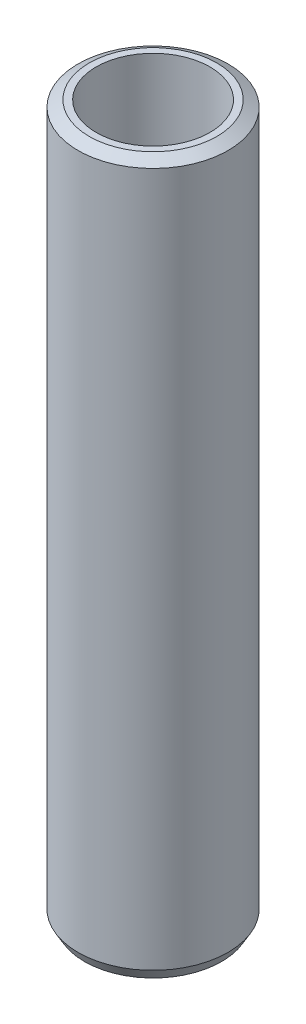
ISO-10303-21;
HEADER;
FILE_DESCRIPTION(('STEP AP214'),'2;1');
FILE_NAME('part.step','',(''),(''),'','','');
FILE_SCHEMA(('AUTOMOTIVE_DESIGN { 1 0 10303 214 1 1 1 1 }'));
ENDSEC;
DATA;
#1=APPLICATION_CONTEXT('core data for automotive mechanical design processes');
#2=APPLICATION_PROTOCOL_DEFINITION('international standard','automotive_design',2000,#1);
#3=PRODUCT_CONTEXT('',#1,'mechanical');
#4=PRODUCT('Part','Part','',(#3));
#5=PRODUCT_RELATED_PRODUCT_CATEGORY('part','',(#4));
#6=PRODUCT_DEFINITION_FORMATION('','',#4);
#7=PRODUCT_DEFINITION_CONTEXT('part definition',#1,'design');
#8=PRODUCT_DEFINITION('design','',#6,#7);
#9=PRODUCT_DEFINITION_SHAPE('','',#8);
#10=(LENGTH_UNIT() NAMED_UNIT(*) SI_UNIT(.MILLI.,.METRE.));
#11=(NAMED_UNIT(*) PLANE_ANGLE_UNIT() SI_UNIT($,.RADIAN.));
#12=(NAMED_UNIT(*) SI_UNIT($,.STERADIAN.) SOLID_ANGLE_UNIT());
#13=UNCERTAINTY_MEASURE_WITH_UNIT(LENGTH_MEASURE(1.E-05),#10,'distance_accuracy_value','');
#14=(GEOMETRIC_REPRESENTATION_CONTEXT(3) GLOBAL_UNCERTAINTY_ASSIGNED_CONTEXT((#13)) GLOBAL_UNIT_ASSIGNED_CONTEXT((#10,
#11,#12)) REPRESENTATION_CONTEXT('',''));
#15=CARTESIAN_POINT('',(0.,0.,0.));
#16=DIRECTION('',(0.,0.,1.));
#17=DIRECTION('',(1.,0.,0.));
#18=AXIS2_PLACEMENT_3D('',#15,#16,#17);
#19=CARTESIAN_POINT('',(0.,474.533639708459,0.));
#20=DIRECTION('',(0.,-1.,0.));
#21=DIRECTION('',(0.,0.,-1.));
#22=AXIS2_PLACEMENT_3D('',#19,#20,#21);
#23=CYLINDRICAL_SURFACE('',#22,50.);
#24=CARTESIAN_POINT('',(0.,470.196097831057,0.));
#25=DIRECTION('',(0.,1.,0.));
#26=DIRECTION('',(0.,0.,1.));
#27=AXIS2_PLACEMENT_3D('',#24,#25,#26);
#28=CIRCLE('',#27,50.);
#29=CARTESIAN_POINT('',(0.,470.196097831057,-50.));
#30=VERTEX_POINT('',#29);
#31=EDGE_CURVE('E50',#30,#30,#28,.F.);
#32=CARTESIAN_POINT('',(0.,7.51284291161775,0.));
#33=DIRECTION('',(0.,1.,0.));
#34=DIRECTION('',(0.,0.,1.));
#35=AXIS2_PLACEMENT_3D('',#32,#33,#34);
#36=CIRCLE('',#35,50.);
#37=CARTESIAN_POINT('',(0.,7.51284291161769,-50.));
#38=VERTEX_POINT('',#37);
#39=EDGE_CURVE('E51',#38,#38,#36,.T.);
#40=CARTESIAN_POINT('',(0.,470.196097831057,-50.));
#41=CARTESIAN_POINT('',(0.,465.376480592313,-50.));
#42=CARTESIAN_POINT('',(0.,460.556863353569,-50.));
#43=CARTESIAN_POINT('',(0.,450.91762887608,-50.));
#44=CARTESIAN_POINT('',(0.,446.098011637336,-50.));
#45=CARTESIAN_POINT('',(0.,436.458777159848,-50.));
#46=CARTESIAN_POINT('',(0.,431.639159921104,-50.));
#47=CARTESIAN_POINT('',(0.,421.999925443615,-50.));
#48=CARTESIAN_POINT('',(0.,417.180308204871,-50.));
#49=CARTESIAN_POINT('',(0.,407.541073727383,-50.));
#50=CARTESIAN_POINT('',(0.,402.721456488639,-50.));
#51=CARTESIAN_POINT('',(0.,393.08222201115,-50.));
#52=CARTESIAN_POINT('',(0.,388.262604772406,-50.));
#53=CARTESIAN_POINT('',(0.,378.623370294918,-50.));
#54=CARTESIAN_POINT('',(0.,373.803753056174,-50.));
#55=CARTESIAN_POINT('',(0.,364.164518578685,-50.));
#56=CARTESIAN_POINT('',(0.,359.344901339941,-50.));
#57=CARTESIAN_POINT('',(0.,349.705666862453,-50.));
#58=CARTESIAN_POINT('',(0.,344.886049623709,-50.));
#59=CARTESIAN_POINT('',(0.,335.246815146221,-50.));
#60=CARTESIAN_POINT('',(0.,330.427197907476,-50.));
#61=CARTESIAN_POINT('',(0.,320.787963429988,-50.));
#62=CARTESIAN_POINT('',(0.,315.968346191244,-50.));
#63=CARTESIAN_POINT('',(0.,306.329111713756,-50.));
#64=CARTESIAN_POINT('',(0.,301.509494475011,-50.));
#65=CARTESIAN_POINT('',(0.,291.870259997523,-50.));
#66=CARTESIAN_POINT('',(0.,287.050642758779,-50.));
#67=CARTESIAN_POINT('',(0.,277.411408281291,-50.));
#68=CARTESIAN_POINT('',(0.,272.591791042546,-50.));
#69=CARTESIAN_POINT('',(0.,262.952556565058,-50.));
#70=CARTESIAN_POINT('',(0.,258.132939326314,-50.));
#71=CARTESIAN_POINT('',(0.,248.493704848826,-50.));
#72=CARTESIAN_POINT('',(0.,243.674087610082,-50.));
#73=CARTESIAN_POINT('',(0.,234.034853132593,-50.));
#74=CARTESIAN_POINT('',(0.,229.215235893849,-50.));
#75=CARTESIAN_POINT('',(0.,219.576001416361,-50.));
#76=CARTESIAN_POINT('',(0.,214.756384177617,-50.));
#77=CARTESIAN_POINT('',(0.,205.117149700128,-50.));
#78=CARTESIAN_POINT('',(0.,200.297532461384,-50.));
#79=CARTESIAN_POINT('',(0.,190.658297983896,-50.));
#80=CARTESIAN_POINT('',(0.,185.838680745152,-50.));
#81=CARTESIAN_POINT('',(0.,176.199446267663,-50.));
#82=CARTESIAN_POINT('',(0.,171.379829028919,-50.));
#83=CARTESIAN_POINT('',(0.,161.740594551431,-50.));
#84=CARTESIAN_POINT('',(0.,156.920977312687,-50.));
#85=CARTESIAN_POINT('',(0.,147.281742835198,-50.));
#86=CARTESIAN_POINT('',(0.,142.462125596454,-50.));
#87=CARTESIAN_POINT('',(0.,132.822891118966,-50.));
#88=CARTESIAN_POINT('',(0.,128.003273880222,-50.));
#89=CARTESIAN_POINT('',(0.,118.364039402733,-50.));
#90=CARTESIAN_POINT('',(0.,113.544422163989,-50.));
#91=CARTESIAN_POINT('',(0.,103.905187686501,-50.));
#92=CARTESIAN_POINT('',(0.,99.0855704477567,-50.));
#93=CARTESIAN_POINT('',(0.,89.4463359702684,-50.));
#94=CARTESIAN_POINT('',(0.,84.6267187315242,-50.));
#95=CARTESIAN_POINT('',(0.,74.9874842540359,-50.));
#96=CARTESIAN_POINT('',(0.,70.1678670152918,-50.));
#97=CARTESIAN_POINT('',(0.,60.5286325378035,-50.));
#98=CARTESIAN_POINT('',(0.,55.7090152990593,-50.));
#99=CARTESIAN_POINT('',(0.,46.069780821571,-50.));
#100=CARTESIAN_POINT('',(0.,41.2501635828268,-50.));
#101=CARTESIAN_POINT('',(0.,31.6109291053385,-50.));
#102=CARTESIAN_POINT('',(0.,26.7913118665943,-50.));
#103=CARTESIAN_POINT('',(0.,17.152077389106,-50.));
#104=CARTESIAN_POINT('',(0.,12.3324601503618,-50.));
#105=CARTESIAN_POINT('',(0.,7.51284291161769,-50.));
#106=B_SPLINE_CURVE_WITH_KNOTS('',3,(#40,#41,#42,#43,#44,#45,#46,#47,#48,#49,#50,#51,#52,#53,
#54,#55,#56,#57,#58,#59,#60,#61,#62,#63,#64,#65,#66,#67,#68,#69,#70,#71,#72,#73,#74,#75,#76,#77,
#78,#79,#80,#81,#82,#83,#84,#85,#86,#87,#88,#89,#90,#91,#92,#93,#94,#95,#96,#97,#98,#99,#100,
#101,#102,#103,#104,#105),.UNSPECIFIED.,.F.,.F.,(4,2,2,2,2,2,2,2,2,2,2,2,2,2,2,2,2,2,2,2,2,2,2,
2,2,2,2,2,2,2,2,2,4),(0.,14.4588517162325,28.9177034324649,43.3765551486974,57.8354068649299,
72.2942585811623,86.7531102973948,101.211962013627,115.67081372986,130.129665446092,
144.588517162325,159.047368878557,173.50622059479,187.965072311022,202.423924027255,
216.882775743487,231.34162745972,245.800479175952,260.259330892185,274.718182608417,
289.17703432465,303.635886040882,318.094737757114,332.553589473347,347.012441189579,
361.471292905812,375.930144622044,390.388996338277,404.847848054509,419.306699770742,
433.765551486974,448.224403203207,462.683254919439),.UNSPECIFIED.);
#107=EDGE_CURVE('BSEAM39',#30,#38,#106,.T.);
#108=ORIENTED_EDGE('',*,*,#31,.T.);
#109=ORIENTED_EDGE('',*,*,#39,.T.);
#110=ORIENTED_EDGE('',*,*,#107,.T.);
#111=ORIENTED_EDGE('',*,*,#107,.F.);
#112=EDGE_LOOP('',(#108,#110,#109,#111));
#113=FACE_BOUND('',#112,.T.);
#114=ADVANCED_FACE('F39',(#113),#23,.T.);
#115=CARTESIAN_POINT('',(0.,474.533639708459,0.));
#116=DIRECTION('',(0.,1.,0.));
#117=DIRECTION('',(0.,0.,1.));
#118=AXIS2_PLACEMENT_3D('',#115,#116,#117);
#119=PLANE('',#118);
#120=CARTESIAN_POINT('',(0.,474.533639708459,0.));
#121=DIRECTION('',(0.,1.,0.));
#122=DIRECTION('',(0.,0.,1.));
#123=AXIS2_PLACEMENT_3D('',#120,#121,#122);
#124=CIRCLE('',#123,42.4871570883829);
#125=CARTESIAN_POINT('',(0.,474.533639708459,42.4871570883829));
#126=VERTEX_POINT('',#125);
#127=EDGE_CURVE('E54',#126,#126,#124,.T.);
#128=ORIENTED_EDGE('',*,*,#127,.T.);
#129=EDGE_LOOP('',(#128));
#130=FACE_BOUND('',#129,.T.);
#131=CARTESIAN_POINT('',(0.,474.533639708459,0.));
#132=DIRECTION('',(0.,1.,0.));
#133=DIRECTION('',(0.,0.,1.));
#134=AXIS2_PLACEMENT_3D('',#131,#132,#133);
#135=CIRCLE('',#134,37.9012233903226);
#136=CARTESIAN_POINT('',(0.,474.533639708459,-37.9012233903226));
#137=VERTEX_POINT('',#136);
#138=EDGE_CURVE('E58',#137,#137,#135,.T.);
#139=ORIENTED_EDGE('',*,*,#138,.F.);
#140=EDGE_LOOP('',(#139));
#141=FACE_BOUND('',#140,.T.);
#142=ADVANCED_FACE('F69',(#130,#141),#119,.T.);
#143=CARTESIAN_POINT('',(0.,0.,0.));
#144=DIRECTION('',(0.,1.,0.));
#145=DIRECTION('',(0.,0.,1.));
#146=AXIS2_PLACEMENT_3D('',#143,#144,#145);
#147=PLANE('',#146);
#148=CARTESIAN_POINT('',(0.,0.,0.));
#149=DIRECTION('',(0.,1.,0.));
#150=DIRECTION('',(0.,0.,1.));
#151=AXIS2_PLACEMENT_3D('',#148,#149,#150);
#152=CIRCLE('',#151,45.6624581225981);
#153=CARTESIAN_POINT('',(0.,0.,45.6624581225981));
#154=VERTEX_POINT('',#153);
#155=EDGE_CURVE('E10',#154,#154,#152,.F.);
#156=ORIENTED_EDGE('',*,*,#155,.T.);
#157=EDGE_LOOP('',(#156));
#158=FACE_BOUND('',#157,.T.);
#159=CARTESIAN_POINT('',(0.,0.,0.));
#160=DIRECTION('',(0.,1.,0.));
#161=DIRECTION('',(0.,0.,1.));
#162=AXIS2_PLACEMENT_3D('',#159,#160,#161);
#163=CIRCLE('',#162,37.9012233903226);
#164=CARTESIAN_POINT('',(0.,0.,-37.9012233903226));
#165=VERTEX_POINT('',#164);
#166=EDGE_CURVE('E63',#165,#165,#163,.T.);
#167=ORIENTED_EDGE('',*,*,#166,.T.);
#168=EDGE_LOOP('',(#167));
#169=FACE_BOUND('',#168,.T.);
#170=ADVANCED_FACE('F75',(#158,#169),#147,.F.);
#171=CARTESIAN_POINT('',(0.,474.533639708459,0.));
#172=DIRECTION('',(0.,-1.,0.));
#173=DIRECTION('',(0.,0.,-1.));
#174=AXIS2_PLACEMENT_3D('',#171,#172,#173);
#175=CYLINDRICAL_SURFACE('',#174,37.9012233903226);
#176=CARTESIAN_POINT('',(0.,474.533639708459,-37.9012233903226));
#177=CARTESIAN_POINT('',(0.,469.590580961495,-37.9012233903226));
#178=CARTESIAN_POINT('',(0.,464.647522214532,-37.9012233903226));
#179=CARTESIAN_POINT('',(0.,454.761404720606,-37.9012233903226));
#180=CARTESIAN_POINT('',(0.,449.818345973643,-37.9012233903226));
#181=CARTESIAN_POINT('',(0.,439.932228479717,-37.9012233903226));
#182=CARTESIAN_POINT('',(0.,434.989169732754,-37.9012233903226));
#183=CARTESIAN_POINT('',(0.,425.103052238827,-37.9012233903226));
#184=CARTESIAN_POINT('',(0.,420.159993491864,-37.9012233903226));
#185=CARTESIAN_POINT('',(0.,410.273875997938,-37.9012233903226));
#186=CARTESIAN_POINT('',(0.,405.330817250975,-37.9012233903226));
#187=CARTESIAN_POINT('',(0.,395.444699757049,-37.9012233903226));
#188=CARTESIAN_POINT('',(0.,390.501641010086,-37.9012233903226));
#189=CARTESIAN_POINT('',(0.,380.615523516159,-37.9012233903226));
#190=CARTESIAN_POINT('',(0.,375.672464769196,-37.9012233903226));
#191=CARTESIAN_POINT('',(0.,365.78634727527,-37.9012233903226));
#192=CARTESIAN_POINT('',(0.,360.843288528307,-37.9012233903226));
#193=CARTESIAN_POINT('',(0.,350.957171034381,-37.9012233903226));
#194=CARTESIAN_POINT('',(0.,346.014112287418,-37.9012233903226));
#195=CARTESIAN_POINT('',(0.,336.127994793492,-37.9012233903226));
#196=CARTESIAN_POINT('',(0.,331.184936046528,-37.9012233903226));
#197=CARTESIAN_POINT('',(0.,321.298818552602,-37.9012233903226));
#198=CARTESIAN_POINT('',(0.,316.355759805639,-37.9012233903226));
#199=CARTESIAN_POINT('',(0.,306.469642311713,-37.9012233903226));
#200=CARTESIAN_POINT('',(0.,301.52658356475,-37.9012233903226));
#201=CARTESIAN_POINT('',(0.,291.640466070823,-37.9012233903226));
#202=CARTESIAN_POINT('',(0.,286.69740732386,-37.9012233903226));
#203=CARTESIAN_POINT('',(0.,276.811289829934,-37.9012233903226));
#204=CARTESIAN_POINT('',(0.,271.868231082971,-37.9012233903226));
#205=CARTESIAN_POINT('',(0.,261.982113589045,-37.9012233903226));
#206=CARTESIAN_POINT('',(0.,257.039054842082,-37.9012233903226));
#207=CARTESIAN_POINT('',(0.,247.152937348156,-37.9012233903226));
#208=CARTESIAN_POINT('',(0.,242.209878601192,-37.9012233903226));
#209=CARTESIAN_POINT('',(0.,232.323761107266,-37.9012233903226));
#210=CARTESIAN_POINT('',(0.,227.380702360303,-37.9012233903226));
#211=CARTESIAN_POINT('',(0.,217.494584866377,-37.9012233903226));
#212=CARTESIAN_POINT('',(0.,212.551526119414,-37.9012233903226));
#213=CARTESIAN_POINT('',(0.,202.665408625488,-37.9012233903226));
#214=CARTESIAN_POINT('',(0.,197.722349878524,-37.9012233903226));
#215=CARTESIAN_POINT('',(0.,187.836232384598,-37.9012233903226));
#216=CARTESIAN_POINT('',(0.,182.893173637635,-37.9012233903226));
#217=CARTESIAN_POINT('',(0.,173.007056143709,-37.9012233903226));
#218=CARTESIAN_POINT('',(0.,168.063997396746,-37.9012233903226));
#219=CARTESIAN_POINT('',(0.,158.17787990282,-37.9012233903226));
#220=CARTESIAN_POINT('',(0.,153.234821155856,-37.9012233903226));
#221=CARTESIAN_POINT('',(0.,143.34870366193,-37.9012233903226));
#222=CARTESIAN_POINT('',(0.,138.405644914967,-37.9012233903226));
#223=CARTESIAN_POINT('',(0.,128.519527421041,-37.9012233903226));
#224=CARTESIAN_POINT('',(0.,123.576468674078,-37.9012233903226));
#225=CARTESIAN_POINT('',(0.,113.690351180152,-37.9012233903226));
#226=CARTESIAN_POINT('',(0.,108.747292433188,-37.9012233903226));
#227=CARTESIAN_POINT('',(0.,98.8611749392622,-37.9012233903226));
#228=CARTESIAN_POINT('',(0.,93.9181161922991,-37.9012233903226));
#229=CARTESIAN_POINT('',(0.,84.0319986983729,-37.9012233903226));
#230=CARTESIAN_POINT('',(0.,79.0889399514098,-37.9012233903226));
#231=CARTESIAN_POINT('',(0.,69.2028224574835,-37.9012233903226));
#232=CARTESIAN_POINT('',(0.,64.2597637105204,-37.9012233903226));
#233=CARTESIAN_POINT('',(0.,54.3736462165942,-37.9012233903226));
#234=CARTESIAN_POINT('',(0.,49.4305874696311,-37.9012233903226));
#235=CARTESIAN_POINT('',(0.,39.5444699757049,-37.9012233903226));
#236=CARTESIAN_POINT('',(0.,34.6014112287418,-37.9012233903226));
#237=CARTESIAN_POINT('',(0.,24.7152937348155,-37.9012233903226));
#238=CARTESIAN_POINT('',(0.,19.7722349878524,-37.9012233903226));
#239=CARTESIAN_POINT('',(0.,9.88611749392621,-37.9012233903226));
#240=CARTESIAN_POINT('',(0.,4.94305874696311,-37.9012233903226));
#241=CARTESIAN_POINT('',(0.,0.,-37.9012233903226));
#242=B_SPLINE_CURVE_WITH_KNOTS('',3,(#176,#177,#178,#179,#180,#181,#182,#183,#184,#185,#186,
#187,#188,#189,#190,#191,#192,#193,#194,#195,#196,#197,#198,#199,#200,#201,#202,#203,#204,#205,
#206,#207,#208,#209,#210,#211,#212,#213,#214,#215,#216,#217,#218,#219,#220,#221,#222,#223,#224,
#225,#226,#227,#228,#229,#230,#231,#232,#233,#234,#235,#236,#237,#238,#239,#240,#241),
.UNSPECIFIED.,.F.,.F.,(4,2,2,2,2,2,2,2,2,2,2,2,2,2,2,2,2,2,2,2,2,2,2,2,2,2,2,2,2,2,2,2,4),(0.,
14.8291762408893,29.6583524817786,44.487528722668,59.3167049635573,74.1458812044466,
88.975057445336,103.804233686225,118.633409927115,133.462586168004,148.291762408893,
163.120938649783,177.950114890672,192.779291131561,207.608467372451,222.43764361334,
237.266819854229,252.095996095119,266.925172336008,281.754348576897,296.583524817787,
311.412701058676,326.241877299565,341.071053540454,355.900229781344,370.729406022233,
385.558582263123,400.387758504012,415.216934744901,430.046110985791,444.87528722668,
459.704463467569,474.533639708459),.UNSPECIFIED.);
#243=EDGE_CURVE('BSEAM70',#137,#165,#242,.T.);
#244=ORIENTED_EDGE('',*,*,#138,.T.);
#245=ORIENTED_EDGE('',*,*,#166,.F.);
#246=ORIENTED_EDGE('',*,*,#243,.T.);
#247=ORIENTED_EDGE('',*,*,#243,.F.);
#248=EDGE_LOOP('',(#244,#246,#245,#247));
#249=FACE_BOUND('',#248,.T.);
#250=ADVANCED_FACE('F70',(#249),#175,.F.);
#251=CARTESIAN_POINT('',(0.,474.533639708459,0.));
#252=DIRECTION('',(0.,-1.,0.));
#253=DIRECTION('',(0.,0.,-1.));
#254=AXIS2_PLACEMENT_3D('',#251,#252,#253);
#255=CONICAL_SURFACE('',#254,42.4871570883829,1.04719755119659);
#256=ORIENTED_EDGE('',*,*,#31,.F.);
#257=EDGE_LOOP('',(#256));
#258=FACE_BOUND('',#257,.T.);
#259=ORIENTED_EDGE('',*,*,#127,.F.);
#260=EDGE_LOOP('',(#259));
#261=FACE_BOUND('',#260,.T.);
#262=ADVANCED_FACE('F81',(#258,#261),#255,.T.);
#263=CARTESIAN_POINT('',(0.,7.51284291161775,0.));
#264=DIRECTION('',(0.,1.,0.));
#265=DIRECTION('',(0.,0.,1.));
#266=AXIS2_PLACEMENT_3D('',#263,#264,#265);
#267=CONICAL_SURFACE('',#266,50.,0.523598775598304);
#268=ORIENTED_EDGE('',*,*,#155,.F.);
#269=EDGE_LOOP('',(#268));
#270=FACE_BOUND('',#269,.T.);
#271=ORIENTED_EDGE('',*,*,#39,.F.);
#272=EDGE_LOOP('',(#271));
#273=FACE_BOUND('',#272,.T.);
#274=ADVANCED_FACE('F45',(#270,#273),#267,.T.);
#275=CLOSED_SHELL('',(#114,#142,#170,#250,#262,#274));
#276=MANIFOLD_SOLID_BREP('B2',#275);
#277=ADVANCED_BREP_SHAPE_REPRESENTATION('',(#18,#276),#14);
#278=SHAPE_DEFINITION_REPRESENTATION(#9,#277);
ENDSEC;
END-ISO-10303-21;
